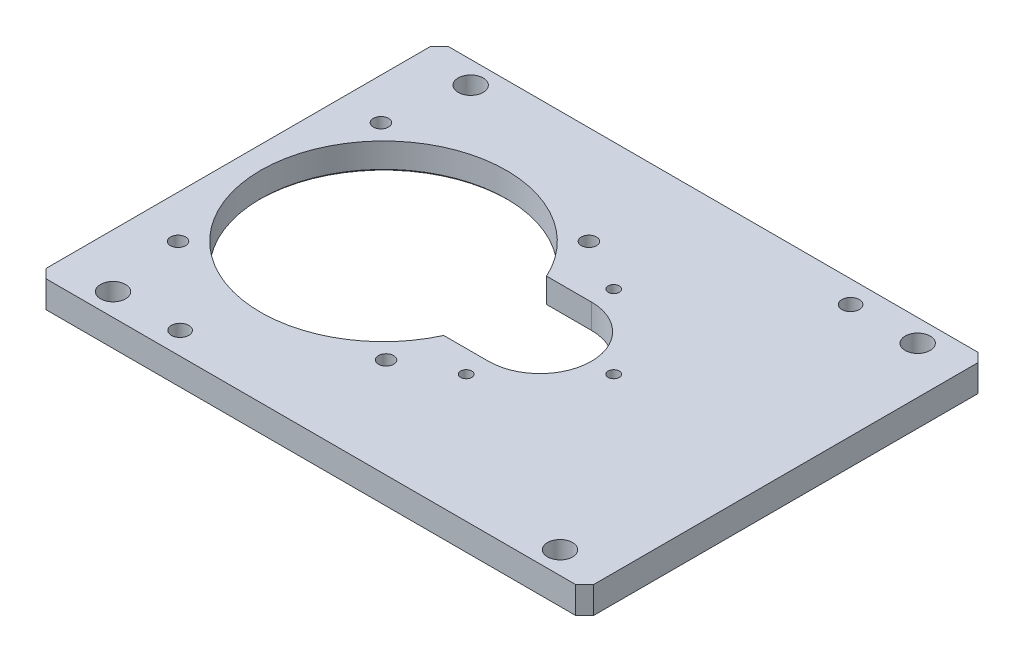
ISO-10303-21;
HEADER;
FILE_DESCRIPTION(('STEP AP214'),'2;1');
FILE_NAME('part.step','',(''),(''),'','','');
FILE_SCHEMA(('AUTOMOTIVE_DESIGN { 1 0 10303 214 1 1 1 1 }'));
ENDSEC;
DATA;
#1=APPLICATION_CONTEXT('core data for automotive mechanical design processes');
#2=APPLICATION_PROTOCOL_DEFINITION('international standard','automotive_design',2000,#1);
#3=PRODUCT_CONTEXT('',#1,'mechanical');
#4=PRODUCT('Part','Part','',(#3));
#5=PRODUCT_RELATED_PRODUCT_CATEGORY('part','',(#4));
#6=PRODUCT_DEFINITION_FORMATION('','',#4);
#7=PRODUCT_DEFINITION_CONTEXT('part definition',#1,'design');
#8=PRODUCT_DEFINITION('design','',#6,#7);
#9=PRODUCT_DEFINITION_SHAPE('','',#8);
#10=(LENGTH_UNIT() NAMED_UNIT(*) SI_UNIT(.MILLI.,.METRE.));
#11=(NAMED_UNIT(*) PLANE_ANGLE_UNIT() SI_UNIT($,.RADIAN.));
#12=(NAMED_UNIT(*) SI_UNIT($,.STERADIAN.) SOLID_ANGLE_UNIT());
#13=UNCERTAINTY_MEASURE_WITH_UNIT(LENGTH_MEASURE(1.E-05),#10,'distance_accuracy_value','');
#14=(GEOMETRIC_REPRESENTATION_CONTEXT(3) GLOBAL_UNCERTAINTY_ASSIGNED_CONTEXT((#13)) GLOBAL_UNIT_ASSIGNED_CONTEXT((#10,
#11,#12)) REPRESENTATION_CONTEXT('',''));
#15=CARTESIAN_POINT('',(0.,0.,0.));
#16=DIRECTION('',(0.,0.,1.));
#17=DIRECTION('',(1.,0.,0.));
#18=AXIS2_PLACEMENT_3D('',#15,#16,#17);
#19=CARTESIAN_POINT('',(0.,12.,0.));
#20=DIRECTION('',(0.,1.,0.));
#21=DIRECTION('',(0.,0.,1.));
#22=AXIS2_PLACEMENT_3D('',#19,#20,#21);
#23=PLANE('',#22);
#24=CARTESIAN_POINT('',(59.,12.,-80.));
#25=DIRECTION('',(0.,1.,0.));
#26=DIRECTION('',(0.,0.,1.));
#27=AXIS2_PLACEMENT_3D('',#24,#25,#26);
#28=CIRCLE('',#27,3.9);
#29=CARTESIAN_POINT('',(59.,12.,-76.1));
#30=VERTEX_POINT('',#29);
#31=EDGE_CURVE('E503',#30,#30,#28,.T.);
#32=ORIENTED_EDGE('',*,*,#31,.F.);
#33=EDGE_LOOP('',(#32));
#34=FACE_BOUND('',#33,.T.);
#35=CARTESIAN_POINT('',(-81.,12.,80.));
#36=DIRECTION('',(0.,1.,0.));
#37=DIRECTION('',(0.,0.,1.));
#38=AXIS2_PLACEMENT_3D('',#35,#36,#37);
#39=CIRCLE('',#38,3.9);
#40=CARTESIAN_POINT('',(-81.,12.,83.9));
#41=VERTEX_POINT('',#40);
#42=EDGE_CURVE('E508',#41,#41,#39,.T.);
#43=ORIENTED_EDGE('',*,*,#42,.F.);
#44=EDGE_LOOP('',(#43));
#45=FACE_BOUND('',#44,.T.);
#46=CARTESIAN_POINT('',(89.,12.,80.));
#47=DIRECTION('',(0.,1.,0.));
#48=DIRECTION('',(0.,0.,1.));
#49=AXIS2_PLACEMENT_3D('',#46,#47,#48);
#50=CIRCLE('',#49,5.6);
#51=CARTESIAN_POINT('',(89.,12.,85.6));
#52=VERTEX_POINT('',#51);
#53=EDGE_CURVE('E521',#52,#52,#50,.T.);
#54=ORIENTED_EDGE('',*,*,#53,.F.);
#55=EDGE_LOOP('',(#54));
#56=FACE_BOUND('',#55,.T.);
#57=CARTESIAN_POINT('',(89.,12.,-80.));
#58=DIRECTION('',(0.,1.,0.));
#59=DIRECTION('',(0.,0.,1.));
#60=AXIS2_PLACEMENT_3D('',#57,#58,#59);
#61=CIRCLE('',#60,5.6);
#62=CARTESIAN_POINT('',(89.,12.,-74.4));
#63=VERTEX_POINT('',#62);
#64=EDGE_CURVE('E531',#63,#63,#61,.T.);
#65=ORIENTED_EDGE('',*,*,#64,.F.);
#66=EDGE_LOOP('',(#65));
#67=FACE_BOUND('',#66,.T.);
#68=CARTESIAN_POINT('',(-111.,12.,-80.));
#69=DIRECTION('',(0.,1.,0.));
#70=DIRECTION('',(0.,0.,1.));
#71=AXIS2_PLACEMENT_3D('',#68,#69,#70);
#72=CIRCLE('',#71,5.6);
#73=CARTESIAN_POINT('',(-111.,12.,-74.4));
#74=VERTEX_POINT('',#73);
#75=EDGE_CURVE('E520',#74,#74,#72,.T.);
#76=ORIENTED_EDGE('',*,*,#75,.F.);
#77=EDGE_LOOP('',(#76));
#78=FACE_BOUND('',#77,.T.);
#79=CARTESIAN_POINT('',(-111.,12.,80.));
#80=DIRECTION('',(0.,1.,0.));
#81=DIRECTION('',(0.,0.,1.));
#82=AXIS2_PLACEMENT_3D('',#79,#80,#81);
#83=CIRCLE('',#82,5.6);
#84=CARTESIAN_POINT('',(-111.,12.,85.6));
#85=VERTEX_POINT('',#84);
#86=EDGE_CURVE('E530',#85,#85,#83,.T.);
#87=ORIENTED_EDGE('',*,*,#86,.F.);
#88=EDGE_LOOP('',(#87));
#89=FACE_BOUND('',#88,.T.);
#90=CARTESIAN_POINT('',(-23.4704473991865,12.,45.3872309660782));
#91=DIRECTION('',(0.,1.,0.));
#92=DIRECTION('',(0.,0.,1.));
#93=AXIS2_PLACEMENT_3D('',#90,#91,#92);
#94=CIRCLE('',#93,3.39999999999999);
#95=CARTESIAN_POINT('',(-23.4704473991865,12.,48.7872309660782));
#96=VERTEX_POINT('',#95);
#97=EDGE_CURVE('E552',#96,#96,#94,.T.);
#98=ORIENTED_EDGE('',*,*,#97,.F.);
#99=EDGE_LOOP('',(#98));
#100=FACE_BOUND('',#99,.T.);
#101=CARTESIAN_POINT('',(-24.0380592228745,12.,-45.9619407771257));
#102=DIRECTION('',(0.,1.,0.));
#103=DIRECTION('',(0.,0.,1.));
#104=AXIS2_PLACEMENT_3D('',#101,#102,#103);
#105=CIRCLE('',#104,3.39999999999999);
#106=CARTESIAN_POINT('',(-24.0380592228745,12.,-42.5619407771257));
#107=VERTEX_POINT('',#106);
#108=EDGE_CURVE('E560',#107,#107,#105,.T.);
#109=ORIENTED_EDGE('',*,*,#108,.F.);
#110=EDGE_LOOP('',(#109));
#111=FACE_BOUND('',#110,.T.);
#112=CARTESIAN_POINT('',(-116.529552600814,12.,-45.3872309660782));
#113=DIRECTION('',(0.,1.,0.));
#114=DIRECTION('',(0.,0.,1.));
#115=AXIS2_PLACEMENT_3D('',#112,#113,#114);
#116=CIRCLE('',#115,3.39999999999999);
#117=CARTESIAN_POINT('',(-116.529552600814,12.,-41.9872309660782));
#118=VERTEX_POINT('',#117);
#119=EDGE_CURVE('E568',#118,#118,#116,.T.);
#120=ORIENTED_EDGE('',*,*,#119,.F.);
#121=EDGE_LOOP('',(#120));
#122=FACE_BOUND('',#121,.T.);
#123=CARTESIAN_POINT('',(33.,12.,0.));
#124=DIRECTION('',(0.,1.,0.));
#125=DIRECTION('',(0.,0.,1.));
#126=AXIS2_PLACEMENT_3D('',#123,#124,#125);
#127=CIRCLE('',#126,2.5);
#128=CARTESIAN_POINT('',(33.,12.,2.5));
#129=VERTEX_POINT('',#128);
#130=EDGE_CURVE('E576',#129,#129,#127,.T.);
#131=ORIENTED_EDGE('',*,*,#130,.F.);
#132=EDGE_LOOP('',(#131));
#133=FACE_BOUND('',#132,.T.);
#134=CARTESIAN_POINT('',(0.,12.,33.));
#135=DIRECTION('',(0.,1.,0.));
#136=DIRECTION('',(0.,0.,1.));
#137=AXIS2_PLACEMENT_3D('',#134,#135,#136);
#138=CIRCLE('',#137,2.5);
#139=CARTESIAN_POINT('',(0.,12.,35.5));
#140=VERTEX_POINT('',#139);
#141=EDGE_CURVE('E584',#140,#140,#138,.T.);
#142=ORIENTED_EDGE('',*,*,#141,.F.);
#143=EDGE_LOOP('',(#142));
#144=FACE_BOUND('',#143,.T.);
#145=CARTESIAN_POINT('',(0.,12.,-33.));
#146=DIRECTION('',(0.,1.,0.));
#147=DIRECTION('',(0.,0.,1.));
#148=AXIS2_PLACEMENT_3D('',#145,#146,#147);
#149=CIRCLE('',#148,2.5);
#150=CARTESIAN_POINT('',(0.,12.,-30.5));
#151=VERTEX_POINT('',#150);
#152=EDGE_CURVE('E347',#151,#151,#149,.T.);
#153=ORIENTED_EDGE('',*,*,#152,.F.);
#154=EDGE_LOOP('',(#153));
#155=FACE_BOUND('',#154,.T.);
#156=CARTESIAN_POINT('',(-115.961940777125,12.,45.9619407771257));
#157=DIRECTION('',(0.,1.,0.));
#158=DIRECTION('',(0.,0.,1.));
#159=AXIS2_PLACEMENT_3D('',#156,#157,#158);
#160=CIRCLE('',#159,3.39999999999999);
#161=CARTESIAN_POINT('',(-115.961940777125,12.,49.3619407771257));
#162=VERTEX_POINT('',#161);
#163=EDGE_CURVE('E598',#162,#162,#160,.T.);
#164=ORIENTED_EDGE('',*,*,#163,.F.);
#165=EDGE_LOOP('',(#164));
#166=FACE_BOUND('',#165,.T.);
#167=DIRECTION('',(-1.,0.,0.));
#168=VECTOR('',#167,1.);
#169=CARTESIAN_POINT('',(-135.,12.,-90.));
#170=LINE('',#169,#168);
#171=CARTESIAN_POINT('',(106.,12.,-90.));
#172=VERTEX_POINT('',#171);
#173=CARTESIAN_POINT('',(-131.,12.,-90.));
#174=VERTEX_POINT('',#173);
#175=EDGE_CURVE('E213',#172,#174,#170,.T.);
#176=ORIENTED_EDGE('',*,*,#175,.T.);
#177=DIRECTION('',(0.70710678118655,0.,-0.707106781186545));
#178=VECTOR('',#177,1.);
#179=CARTESIAN_POINT('',(-110.5,12.,-110.5));
#180=LINE('',#179,#178);
#181=CARTESIAN_POINT('',(-135.,12.,-86.));
#182=VERTEX_POINT('',#181);
#183=EDGE_CURVE('E266',#174,#182,#180,.F.);
#184=ORIENTED_EDGE('',*,*,#183,.T.);
#185=DIRECTION('',(0.,0.,1.));
#186=VECTOR('',#185,1.);
#187=CARTESIAN_POINT('',(-135.,12.,-90.));
#188=LINE('',#187,#186);
#189=CARTESIAN_POINT('',(-135.,12.,85.9999999999999));
#190=VERTEX_POINT('',#189);
#191=EDGE_CURVE('E200',#182,#190,#188,.T.);
#192=ORIENTED_EDGE('',*,*,#191,.T.);
#193=DIRECTION('',(-0.707106781186548,0.,-0.707106781186548));
#194=VECTOR('',#193,1.);
#195=CARTESIAN_POINT('',(-110.5,12.,110.5));
#196=LINE('',#195,#194);
#197=CARTESIAN_POINT('',(-131.,12.,90.));
#198=VERTEX_POINT('',#197);
#199=EDGE_CURVE('E257',#190,#198,#196,.F.);
#200=ORIENTED_EDGE('',*,*,#199,.T.);
#201=DIRECTION('',(1.,0.,0.));
#202=VECTOR('',#201,1.);
#203=CARTESIAN_POINT('',(-135.,12.,90.));
#204=LINE('',#203,#202);
#205=CARTESIAN_POINT('',(106.,12.,90.));
#206=VERTEX_POINT('',#205);
#207=EDGE_CURVE('E204',#198,#206,#204,.T.);
#208=ORIENTED_EDGE('',*,*,#207,.T.);
#209=DIRECTION('',(-0.707106781186551,0.,0.707106781186544));
#210=VECTOR('',#209,1.);
#211=CARTESIAN_POINT('',(97.9999999999994,12.,98.0000000000005));
#212=LINE('',#211,#210);
#213=CARTESIAN_POINT('',(110.,12.,86.));
#214=VERTEX_POINT('',#213);
#215=EDGE_CURVE('E260',#206,#214,#212,.F.);
#216=ORIENTED_EDGE('',*,*,#215,.T.);
#217=DIRECTION('',(0.,0.,-1.));
#218=VECTOR('',#217,1.);
#219=CARTESIAN_POINT('',(110.,12.,-90.));
#220=LINE('',#219,#218);
#221=CARTESIAN_POINT('',(110.,12.,-85.9999999999999));
#222=VERTEX_POINT('',#221);
#223=EDGE_CURVE('E209',#214,#222,#220,.T.);
#224=ORIENTED_EDGE('',*,*,#223,.T.);
#225=DIRECTION('',(0.707106781186544,0.,0.707106781186551));
#226=VECTOR('',#225,1.);
#227=CARTESIAN_POINT('',(98.0000000000005,12.,-97.9999999999995));
#228=LINE('',#227,#226);
#229=EDGE_CURVE('E263',#222,#172,#228,.F.);
#230=ORIENTED_EDGE('',*,*,#229,.T.);
#231=EDGE_LOOP('',(#176,#184,#192,#200,#208,#216,#224,#230));
#232=FACE_BOUND('',#231,.T.);
#233=DIRECTION('',(-1.,0.,0.));
#234=VECTOR('',#233,1.);
#235=CARTESIAN_POINT('',(0.,12.,-23.));
#236=LINE('',#235,#234);
#237=CARTESIAN_POINT('',(0.,12.,-23.));
#238=VERTEX_POINT('',#237);
#239=CARTESIAN_POINT('',(-20.0400160128128,12.,-23.));
#240=VERTEX_POINT('',#239);
#241=EDGE_CURVE('E167',#238,#240,#236,.T.);
#242=ORIENTED_EDGE('',*,*,#241,.F.);
#243=CARTESIAN_POINT('',(0.,12.,0.));
#244=DIRECTION('',(0.,1.,0.));
#245=DIRECTION('',(0.,0.,1.));
#246=AXIS2_PLACEMENT_3D('',#243,#244,#245);
#247=CIRCLE('',#246,23.);
#248=CARTESIAN_POINT('',(0.,12.,23.));
#249=VERTEX_POINT('',#248);
#250=EDGE_CURVE('E158',#249,#238,#247,.T.);
#251=ORIENTED_EDGE('',*,*,#250,.F.);
#252=DIRECTION('',(1.,0.,0.));
#253=VECTOR('',#252,1.);
#254=CARTESIAN_POINT('',(0.,12.,23.));
#255=LINE('',#254,#253);
#256=CARTESIAN_POINT('',(-20.0400160128128,12.,23.));
#257=VERTEX_POINT('',#256);
#258=EDGE_CURVE('E187',#257,#249,#255,.T.);
#259=ORIENTED_EDGE('',*,*,#258,.F.);
#260=CARTESIAN_POINT('',(-70.,12.,0.));
#261=DIRECTION('',(0.,1.,0.));
#262=DIRECTION('',(0.,0.,1.));
#263=AXIS2_PLACEMENT_3D('',#260,#261,#262);
#264=CIRCLE('',#263,55.);
#265=EDGE_CURVE('E183',#240,#257,#264,.T.);
#266=ORIENTED_EDGE('',*,*,#265,.F.);
#267=EDGE_LOOP('',(#242,#251,#259,#266));
#268=FACE_BOUND('',#267,.T.);
#269=ADVANCED_FACE('F55',(#34,#45,#56,#67,#78,#89,#100,#111,#122,#133,#144,#155,#166,#232,#268),
#23,.T.);
#270=CARTESIAN_POINT('',(0.,0.,0.));
#271=DIRECTION('',(0.,1.,0.));
#272=DIRECTION('',(0.,0.,1.));
#273=AXIS2_PLACEMENT_3D('',#270,#271,#272);
#274=PLANE('',#273);
#275=CARTESIAN_POINT('',(59.,0.,-80.));
#276=DIRECTION('',(0.,1.,0.));
#277=DIRECTION('',(0.,0.,1.));
#278=AXIS2_PLACEMENT_3D('',#275,#276,#277);
#279=CIRCLE('',#278,3.9);
#280=CARTESIAN_POINT('',(59.,0.,-76.1));
#281=VERTEX_POINT('',#280);
#282=EDGE_CURVE('E506',#281,#281,#279,.F.);
#283=ORIENTED_EDGE('',*,*,#282,.F.);
#284=EDGE_LOOP('',(#283));
#285=FACE_BOUND('',#284,.T.);
#286=CARTESIAN_POINT('',(-81.,0.,80.));
#287=DIRECTION('',(0.,1.,0.));
#288=DIRECTION('',(0.,0.,1.));
#289=AXIS2_PLACEMENT_3D('',#286,#287,#288);
#290=CIRCLE('',#289,3.9);
#291=CARTESIAN_POINT('',(-81.,0.,83.9));
#292=VERTEX_POINT('',#291);
#293=EDGE_CURVE('E513',#292,#292,#290,.F.);
#294=ORIENTED_EDGE('',*,*,#293,.F.);
#295=EDGE_LOOP('',(#294));
#296=FACE_BOUND('',#295,.T.);
#297=CARTESIAN_POINT('',(89.,0.,80.));
#298=DIRECTION('',(0.,1.,0.));
#299=DIRECTION('',(0.,0.,1.));
#300=AXIS2_PLACEMENT_3D('',#297,#298,#299);
#301=CIRCLE('',#300,5.6);
#302=CARTESIAN_POINT('',(89.,0.,85.6));
#303=VERTEX_POINT('',#302);
#304=EDGE_CURVE('E525',#303,#303,#301,.F.);
#305=ORIENTED_EDGE('',*,*,#304,.F.);
#306=EDGE_LOOP('',(#305));
#307=FACE_BOUND('',#306,.T.);
#308=CARTESIAN_POINT('',(89.,0.,-80.));
#309=DIRECTION('',(0.,1.,0.));
#310=DIRECTION('',(0.,0.,1.));
#311=AXIS2_PLACEMENT_3D('',#308,#309,#310);
#312=CIRCLE('',#311,5.6);
#313=CARTESIAN_POINT('',(89.,0.,-74.4));
#314=VERTEX_POINT('',#313);
#315=EDGE_CURVE('E526',#314,#314,#312,.F.);
#316=ORIENTED_EDGE('',*,*,#315,.F.);
#317=EDGE_LOOP('',(#316));
#318=FACE_BOUND('',#317,.T.);
#319=CARTESIAN_POINT('',(-111.,0.,-80.));
#320=DIRECTION('',(0.,1.,0.));
#321=DIRECTION('',(0.,0.,1.));
#322=AXIS2_PLACEMENT_3D('',#319,#320,#321);
#323=CIRCLE('',#322,5.6);
#324=CARTESIAN_POINT('',(-111.,0.,-74.4));
#325=VERTEX_POINT('',#324);
#326=EDGE_CURVE('E535',#325,#325,#323,.F.);
#327=ORIENTED_EDGE('',*,*,#326,.F.);
#328=EDGE_LOOP('',(#327));
#329=FACE_BOUND('',#328,.T.);
#330=CARTESIAN_POINT('',(-111.,0.,80.));
#331=DIRECTION('',(0.,1.,0.));
#332=DIRECTION('',(0.,0.,1.));
#333=AXIS2_PLACEMENT_3D('',#330,#331,#332);
#334=CIRCLE('',#333,5.6);
#335=CARTESIAN_POINT('',(-111.,0.,85.6));
#336=VERTEX_POINT('',#335);
#337=EDGE_CURVE('E548',#336,#336,#334,.F.);
#338=ORIENTED_EDGE('',*,*,#337,.F.);
#339=EDGE_LOOP('',(#338));
#340=FACE_BOUND('',#339,.T.);
#341=CARTESIAN_POINT('',(-23.4704473991865,0.,45.3872309660782));
#342=DIRECTION('',(0.,1.,0.));
#343=DIRECTION('',(0.,0.,1.));
#344=AXIS2_PLACEMENT_3D('',#341,#342,#343);
#345=CIRCLE('',#344,3.39999999999999);
#346=CARTESIAN_POINT('',(-23.4704473991865,0.,48.7872309660782));
#347=VERTEX_POINT('',#346);
#348=EDGE_CURVE('E556',#347,#347,#345,.T.);
#349=ORIENTED_EDGE('',*,*,#348,.T.);
#350=EDGE_LOOP('',(#349));
#351=FACE_BOUND('',#350,.T.);
#352=CARTESIAN_POINT('',(-24.0380592228745,0.,-45.9619407771257));
#353=DIRECTION('',(0.,1.,0.));
#354=DIRECTION('',(0.,0.,1.));
#355=AXIS2_PLACEMENT_3D('',#352,#353,#354);
#356=CIRCLE('',#355,3.39999999999999);
#357=CARTESIAN_POINT('',(-24.0380592228745,0.,-42.5619407771257));
#358=VERTEX_POINT('',#357);
#359=EDGE_CURVE('E564',#358,#358,#356,.T.);
#360=ORIENTED_EDGE('',*,*,#359,.T.);
#361=EDGE_LOOP('',(#360));
#362=FACE_BOUND('',#361,.T.);
#363=CARTESIAN_POINT('',(-116.529552600814,0.,-45.3872309660782));
#364=DIRECTION('',(0.,1.,0.));
#365=DIRECTION('',(0.,0.,1.));
#366=AXIS2_PLACEMENT_3D('',#363,#364,#365);
#367=CIRCLE('',#366,3.39999999999999);
#368=CARTESIAN_POINT('',(-116.529552600814,0.,-41.9872309660782));
#369=VERTEX_POINT('',#368);
#370=EDGE_CURVE('E572',#369,#369,#367,.T.);
#371=ORIENTED_EDGE('',*,*,#370,.T.);
#372=EDGE_LOOP('',(#371));
#373=FACE_BOUND('',#372,.T.);
#374=CARTESIAN_POINT('',(33.,0.,0.));
#375=DIRECTION('',(0.,1.,0.));
#376=DIRECTION('',(0.,0.,1.));
#377=AXIS2_PLACEMENT_3D('',#374,#375,#376);
#378=CIRCLE('',#377,2.5);
#379=CARTESIAN_POINT('',(33.,0.,2.5));
#380=VERTEX_POINT('',#379);
#381=EDGE_CURVE('E580',#380,#380,#378,.T.);
#382=ORIENTED_EDGE('',*,*,#381,.T.);
#383=EDGE_LOOP('',(#382));
#384=FACE_BOUND('',#383,.T.);
#385=CARTESIAN_POINT('',(0.,0.,33.));
#386=DIRECTION('',(0.,1.,0.));
#387=DIRECTION('',(0.,0.,1.));
#388=AXIS2_PLACEMENT_3D('',#385,#386,#387);
#389=CIRCLE('',#388,2.5);
#390=CARTESIAN_POINT('',(0.,0.,35.5));
#391=VERTEX_POINT('',#390);
#392=EDGE_CURVE('E312',#391,#391,#389,.T.);
#393=ORIENTED_EDGE('',*,*,#392,.T.);
#394=EDGE_LOOP('',(#393));
#395=FACE_BOUND('',#394,.T.);
#396=CARTESIAN_POINT('',(0.,0.,0.));
#397=DIRECTION('',(0.,1.,0.));
#398=DIRECTION('',(0.,0.,1.));
#399=AXIS2_PLACEMENT_3D('',#396,#397,#398);
#400=CIRCLE('',#399,24.);
#401=CARTESIAN_POINT('',(0.,0.,24.));
#402=VERTEX_POINT('',#401);
#403=CARTESIAN_POINT('',(0.,0.,-24.));
#404=VERTEX_POINT('',#403);
#405=EDGE_CURVE('E289',#402,#404,#400,.T.);
#406=ORIENTED_EDGE('',*,*,#405,.T.);
#407=DIRECTION('',(-1.,0.,0.));
#408=VECTOR('',#407,1.);
#409=CARTESIAN_POINT('',(-20.0400160128128,0.,-24.));
#410=LINE('',#409,#408);
#411=CARTESIAN_POINT('',(-19.403557437306,0.,-24.));
#412=VERTEX_POINT('',#411);
#413=EDGE_CURVE('E292',#404,#412,#410,.T.);
#414=ORIENTED_EDGE('',*,*,#413,.T.);
#415=CARTESIAN_POINT('',(-70.,0.,0.));
#416=DIRECTION('',(0.,1.,0.));
#417=DIRECTION('',(0.,0.,1.));
#418=AXIS2_PLACEMENT_3D('',#415,#416,#417);
#419=CIRCLE('',#418,56.);
#420=CARTESIAN_POINT('',(-19.403557437306,0.,24.));
#421=VERTEX_POINT('',#420);
#422=EDGE_CURVE('E283',#412,#421,#419,.T.);
#423=ORIENTED_EDGE('',*,*,#422,.T.);
#424=DIRECTION('',(1.,0.,0.));
#425=VECTOR('',#424,1.);
#426=CARTESIAN_POINT('',(0.,0.,24.));
#427=LINE('',#426,#425);
#428=EDGE_CURVE('E286',#421,#402,#427,.T.);
#429=ORIENTED_EDGE('',*,*,#428,.T.);
#430=EDGE_LOOP('',(#406,#414,#423,#429));
#431=FACE_BOUND('',#430,.T.);
#432=CARTESIAN_POINT('',(0.,0.,-33.));
#433=DIRECTION('',(0.,1.,0.));
#434=DIRECTION('',(0.,0.,1.));
#435=AXIS2_PLACEMENT_3D('',#432,#433,#434);
#436=CIRCLE('',#435,2.5);
#437=CARTESIAN_POINT('',(0.,0.,-30.5));
#438=VERTEX_POINT('',#437);
#439=EDGE_CURVE('E594',#438,#438,#436,.T.);
#440=ORIENTED_EDGE('',*,*,#439,.T.);
#441=EDGE_LOOP('',(#440));
#442=FACE_BOUND('',#441,.T.);
#443=CARTESIAN_POINT('',(-115.961940777125,0.,45.9619407771257));
#444=DIRECTION('',(0.,1.,0.));
#445=DIRECTION('',(0.,0.,1.));
#446=AXIS2_PLACEMENT_3D('',#443,#444,#445);
#447=CIRCLE('',#446,3.39999999999999);
#448=CARTESIAN_POINT('',(-115.961940777125,0.,49.3619407771257));
#449=VERTEX_POINT('',#448);
#450=EDGE_CURVE('E168',#449,#449,#447,.T.);
#451=ORIENTED_EDGE('',*,*,#450,.T.);
#452=EDGE_LOOP('',(#451));
#453=FACE_BOUND('',#452,.T.);
#454=DIRECTION('',(0.,0.,1.));
#455=VECTOR('',#454,1.);
#456=CARTESIAN_POINT('',(-135.,0.,-90.));
#457=LINE('',#456,#455);
#458=CARTESIAN_POINT('',(-135.,0.,-86.));
#459=VERTEX_POINT('',#458);
#460=CARTESIAN_POINT('',(-135.,0.,85.9999999999999));
#461=VERTEX_POINT('',#460);
#462=EDGE_CURVE('E178',#459,#461,#457,.T.);
#463=ORIENTED_EDGE('',*,*,#462,.F.);
#464=DIRECTION('',(-0.70710678118655,0.,0.707106781186545));
#465=VECTOR('',#464,1.);
#466=CARTESIAN_POINT('',(-135.,0.,-86.));
#467=LINE('',#466,#465);
#468=CARTESIAN_POINT('',(-131.,0.,-90.));
#469=VERTEX_POINT('',#468);
#470=EDGE_CURVE('E247',#459,#469,#467,.F.);
#471=ORIENTED_EDGE('',*,*,#470,.T.);
#472=DIRECTION('',(-1.,0.,0.));
#473=VECTOR('',#472,1.);
#474=CARTESIAN_POINT('',(-135.,0.,-90.));
#475=LINE('',#474,#473);
#476=CARTESIAN_POINT('',(106.,0.,-90.));
#477=VERTEX_POINT('',#476);
#478=EDGE_CURVE('E205',#477,#469,#475,.T.);
#479=ORIENTED_EDGE('',*,*,#478,.F.);
#480=DIRECTION('',(-0.707106781186544,0.,-0.707106781186551));
#481=VECTOR('',#480,1.);
#482=CARTESIAN_POINT('',(106.,0.,-90.));
#483=LINE('',#482,#481);
#484=CARTESIAN_POINT('',(110.,0.,-85.9999999999999));
#485=VERTEX_POINT('',#484);
#486=EDGE_CURVE('E244',#477,#485,#483,.F.);
#487=ORIENTED_EDGE('',*,*,#486,.T.);
#488=DIRECTION('',(0.,0.,-1.));
#489=VECTOR('',#488,1.);
#490=CARTESIAN_POINT('',(110.,0.,-90.));
#491=LINE('',#490,#489);
#492=CARTESIAN_POINT('',(110.,0.,86.));
#493=VERTEX_POINT('',#492);
#494=EDGE_CURVE('E225',#493,#485,#491,.T.);
#495=ORIENTED_EDGE('',*,*,#494,.F.);
#496=DIRECTION('',(0.707106781186551,0.,-0.707106781186544));
#497=VECTOR('',#496,1.);
#498=CARTESIAN_POINT('',(110.,0.,86.));
#499=LINE('',#498,#497);
#500=CARTESIAN_POINT('',(106.,0.,90.));
#501=VERTEX_POINT('',#500);
#502=EDGE_CURVE('E241',#493,#501,#499,.F.);
#503=ORIENTED_EDGE('',*,*,#502,.T.);
#504=DIRECTION('',(1.,0.,0.));
#505=VECTOR('',#504,1.);
#506=CARTESIAN_POINT('',(-135.,0.,90.));
#507=LINE('',#506,#505);
#508=CARTESIAN_POINT('',(-131.,0.,90.));
#509=VERTEX_POINT('',#508);
#510=EDGE_CURVE('E221',#509,#501,#507,.T.);
#511=ORIENTED_EDGE('',*,*,#510,.F.);
#512=DIRECTION('',(0.707106781186548,0.,0.707106781186548));
#513=VECTOR('',#512,1.);
#514=CARTESIAN_POINT('',(-131.,0.,90.));
#515=LINE('',#514,#513);
#516=EDGE_CURVE('E238',#509,#461,#515,.F.);
#517=ORIENTED_EDGE('',*,*,#516,.T.);
#518=EDGE_LOOP('',(#463,#471,#479,#487,#495,#503,#511,#517));
#519=FACE_BOUND('',#518,.T.);
#520=ADVANCED_FACE('F371',(#285,#296,#307,#318,#329,#340,#351,#362,#373,#384,#395,#431,#442,
#453,#519),#274,.F.);
#521=CARTESIAN_POINT('',(-135.,12.,-90.));
#522=DIRECTION('',(1.,0.,0.));
#523=DIRECTION('',(0.,0.,-1.));
#524=AXIS2_PLACEMENT_3D('',#521,#522,#523);
#525=PLANE('',#524);
#526=ORIENTED_EDGE('',*,*,#191,.F.);
#527=DIRECTION('',(0.,-1.,0.));
#528=VECTOR('',#527,1.);
#529=CARTESIAN_POINT('',(-135.,12.,-86.));
#530=LINE('',#529,#528);
#531=EDGE_CURVE('E234',#182,#459,#530,.T.);
#532=ORIENTED_EDGE('',*,*,#531,.T.);
#533=ORIENTED_EDGE('',*,*,#462,.T.);
#534=DIRECTION('',(0.,1.,0.));
#535=VECTOR('',#534,1.);
#536=CARTESIAN_POINT('',(-135.,12.,86.));
#537=LINE('',#536,#535);
#538=EDGE_CURVE('E217',#461,#190,#537,.T.);
#539=ORIENTED_EDGE('',*,*,#538,.T.);
#540=EDGE_LOOP('',(#526,#532,#533,#539));
#541=FACE_BOUND('',#540,.T.);
#542=ADVANCED_FACE('F378',(#541),#525,.F.);
#543=CARTESIAN_POINT('',(-135.,12.,90.));
#544=DIRECTION('',(0.,0.,-1.));
#545=DIRECTION('',(-1.,0.,0.));
#546=AXIS2_PLACEMENT_3D('',#543,#544,#545);
#547=PLANE('',#546);
#548=ORIENTED_EDGE('',*,*,#510,.T.);
#549=DIRECTION('',(0.,1.,0.));
#550=VECTOR('',#549,1.);
#551=CARTESIAN_POINT('',(106.,12.,90.));
#552=LINE('',#551,#550);
#553=EDGE_CURVE('E280',#501,#206,#552,.T.);
#554=ORIENTED_EDGE('',*,*,#553,.T.);
#555=ORIENTED_EDGE('',*,*,#207,.F.);
#556=DIRECTION('',(0.,-1.,0.));
#557=VECTOR('',#556,1.);
#558=CARTESIAN_POINT('',(-131.,12.,90.));
#559=LINE('',#558,#557);
#560=EDGE_CURVE('E276',#198,#509,#559,.T.);
#561=ORIENTED_EDGE('',*,*,#560,.T.);
#562=EDGE_LOOP('',(#548,#554,#555,#561));
#563=FACE_BOUND('',#562,.T.);
#564=ADVANCED_FACE('F393',(#563),#547,.F.);
#565=CARTESIAN_POINT('',(110.,12.,-90.));
#566=DIRECTION('',(-1.,0.,0.));
#567=DIRECTION('',(0.,0.,1.));
#568=AXIS2_PLACEMENT_3D('',#565,#566,#567);
#569=PLANE('',#568);
#570=ORIENTED_EDGE('',*,*,#494,.T.);
#571=DIRECTION('',(0.,1.,0.));
#572=VECTOR('',#571,1.);
#573=CARTESIAN_POINT('',(110.,12.,-85.9999999999999));
#574=LINE('',#573,#572);
#575=EDGE_CURVE('E273',#485,#222,#574,.T.);
#576=ORIENTED_EDGE('',*,*,#575,.T.);
#577=ORIENTED_EDGE('',*,*,#223,.F.);
#578=DIRECTION('',(0.,-1.,0.));
#579=VECTOR('',#578,1.);
#580=CARTESIAN_POINT('',(110.,12.,86.));
#581=LINE('',#580,#579);
#582=EDGE_CURVE('E269',#214,#493,#581,.T.);
#583=ORIENTED_EDGE('',*,*,#582,.T.);
#584=EDGE_LOOP('',(#570,#576,#577,#583));
#585=FACE_BOUND('',#584,.T.);
#586=ADVANCED_FACE('F389',(#585),#569,.F.);
#587=CARTESIAN_POINT('',(-135.,12.,-90.));
#588=DIRECTION('',(0.,0.,1.));
#589=DIRECTION('',(1.,0.,0.));
#590=AXIS2_PLACEMENT_3D('',#587,#588,#589);
#591=PLANE('',#590);
#592=ORIENTED_EDGE('',*,*,#478,.T.);
#593=DIRECTION('',(0.,1.,0.));
#594=VECTOR('',#593,1.);
#595=CARTESIAN_POINT('',(-131.,12.,-90.));
#596=LINE('',#595,#594);
#597=EDGE_CURVE('E254',#469,#174,#596,.T.);
#598=ORIENTED_EDGE('',*,*,#597,.T.);
#599=ORIENTED_EDGE('',*,*,#175,.F.);
#600=DIRECTION('',(0.,-1.,0.));
#601=VECTOR('',#600,1.);
#602=CARTESIAN_POINT('',(106.,12.,-90.));
#603=LINE('',#602,#601);
#604=EDGE_CURVE('E250',#172,#477,#603,.T.);
#605=ORIENTED_EDGE('',*,*,#604,.T.);
#606=EDGE_LOOP('',(#592,#598,#599,#605));
#607=FACE_BOUND('',#606,.T.);
#608=ADVANCED_FACE('F386',(#607),#591,.F.);
#609=CARTESIAN_POINT('',(0.,12.,0.));
#610=DIRECTION('',(0.,-1.,0.));
#611=DIRECTION('',(0.,0.,-1.));
#612=AXIS2_PLACEMENT_3D('',#609,#610,#611);
#613=CYLINDRICAL_SURFACE('',#612,23.);
#614=DIRECTION('',(0.,-1.,0.));
#615=VECTOR('',#614,1.);
#616=CARTESIAN_POINT('',(0.,12.,-23.));
#617=LINE('',#616,#615);
#618=CARTESIAN_POINT('',(0.,0.999999999999959,-23.));
#619=VERTEX_POINT('',#618);
#620=EDGE_CURVE('E161',#238,#619,#617,.T.);
#621=ORIENTED_EDGE('',*,*,#620,.T.);
#622=CARTESIAN_POINT('',(0.,0.999999999999959,0.));
#623=DIRECTION('',(0.,1.,0.));
#624=DIRECTION('',(0.,0.,1.));
#625=AXIS2_PLACEMENT_3D('',#622,#623,#624);
#626=CIRCLE('',#625,23.);
#627=CARTESIAN_POINT('',(0.,0.999999999999959,23.));
#628=VERTEX_POINT('',#627);
#629=EDGE_CURVE('E81',#619,#628,#626,.F.);
#630=ORIENTED_EDGE('',*,*,#629,.T.);
#631=DIRECTION('',(0.,-1.,0.));
#632=VECTOR('',#631,1.);
#633=CARTESIAN_POINT('',(0.,12.,23.));
#634=LINE('',#633,#632);
#635=EDGE_CURVE('E162',#249,#628,#634,.T.);
#636=ORIENTED_EDGE('',*,*,#635,.F.);
#637=ORIENTED_EDGE('',*,*,#250,.T.);
#638=EDGE_LOOP('',(#621,#630,#636,#637));
#639=FACE_BOUND('',#638,.T.);
#640=ADVANCED_FACE('F160',(#639),#613,.F.);
#641=CARTESIAN_POINT('',(0.,12.,-23.));
#642=DIRECTION('',(0.,0.,1.));
#643=DIRECTION('',(1.,0.,0.));
#644=AXIS2_PLACEMENT_3D('',#641,#642,#643);
#645=PLANE('',#644);
#646=DIRECTION('',(0.,-1.,0.));
#647=VECTOR('',#646,1.);
#648=CARTESIAN_POINT('',(-20.0400160128128,12.,-23.));
#649=LINE('',#648,#647);
#650=CARTESIAN_POINT('',(-20.0400160128128,0.999999999999959,-23.));
#651=VERTEX_POINT('',#650);
#652=EDGE_CURVE('E179',#240,#651,#649,.T.);
#653=ORIENTED_EDGE('',*,*,#652,.T.);
#654=DIRECTION('',(1.,0.,0.));
#655=VECTOR('',#654,1.);
#656=CARTESIAN_POINT('',(0.,0.999999999999959,-23.));
#657=LINE('',#656,#655);
#658=EDGE_CURVE('E176',#651,#619,#657,.T.);
#659=ORIENTED_EDGE('',*,*,#658,.T.);
#660=ORIENTED_EDGE('',*,*,#620,.F.);
#661=ORIENTED_EDGE('',*,*,#241,.T.);
#662=EDGE_LOOP('',(#653,#659,#660,#661));
#663=FACE_BOUND('',#662,.T.);
#664=ADVANCED_FACE('F173',(#663),#645,.T.);
#665=CARTESIAN_POINT('',(-70.,12.,0.));
#666=DIRECTION('',(0.,-1.,0.));
#667=DIRECTION('',(0.,0.,-1.));
#668=AXIS2_PLACEMENT_3D('',#665,#666,#667);
#669=CYLINDRICAL_SURFACE('',#668,55.);
#670=DIRECTION('',(0.,-1.,0.));
#671=VECTOR('',#670,1.);
#672=CARTESIAN_POINT('',(-20.0400160128128,12.,23.));
#673=LINE('',#672,#671);
#674=CARTESIAN_POINT('',(-20.0400160128128,0.999999999999959,23.));
#675=VERTEX_POINT('',#674);
#676=EDGE_CURVE('E195',#257,#675,#673,.T.);
#677=ORIENTED_EDGE('',*,*,#676,.T.);
#678=CARTESIAN_POINT('',(-70.,0.999999999999959,0.));
#679=DIRECTION('',(0.,1.,0.));
#680=DIRECTION('',(0.,0.,1.));
#681=AXIS2_PLACEMENT_3D('',#678,#679,#680);
#682=CIRCLE('',#681,55.);
#683=EDGE_CURVE('E11',#675,#651,#682,.F.);
#684=ORIENTED_EDGE('',*,*,#683,.T.);
#685=ORIENTED_EDGE('',*,*,#652,.F.);
#686=ORIENTED_EDGE('',*,*,#265,.T.);
#687=EDGE_LOOP('',(#677,#684,#685,#686));
#688=FACE_BOUND('',#687,.T.);
#689=ADVANCED_FACE('F356',(#688),#669,.F.);
#690=CARTESIAN_POINT('',(0.,12.,23.));
#691=DIRECTION('',(0.,0.,-1.));
#692=DIRECTION('',(-1.,0.,0.));
#693=AXIS2_PLACEMENT_3D('',#690,#691,#692);
#694=PLANE('',#693);
#695=ORIENTED_EDGE('',*,*,#635,.T.);
#696=DIRECTION('',(-1.,0.,0.));
#697=VECTOR('',#696,1.);
#698=CARTESIAN_POINT('',(-20.0400160128128,0.999999999999959,23.));
#699=LINE('',#698,#697);
#700=EDGE_CURVE('E66',#628,#675,#699,.T.);
#701=ORIENTED_EDGE('',*,*,#700,.T.);
#702=ORIENTED_EDGE('',*,*,#676,.F.);
#703=ORIENTED_EDGE('',*,*,#258,.T.);
#704=EDGE_LOOP('',(#695,#701,#702,#703));
#705=FACE_BOUND('',#704,.T.);
#706=ADVANCED_FACE('F357',(#705),#694,.T.);
#707=CARTESIAN_POINT('',(-135.,12.,-86.));
#708=DIRECTION('',(0.707106781186545,0.,0.70710678118655));
#709=DIRECTION('',(0.,-1.,0.));
#710=AXIS2_PLACEMENT_3D('',#707,#708,#709);
#711=PLANE('',#710);
#712=ORIENTED_EDGE('',*,*,#183,.F.);
#713=ORIENTED_EDGE('',*,*,#597,.F.);
#714=ORIENTED_EDGE('',*,*,#470,.F.);
#715=ORIENTED_EDGE('',*,*,#531,.F.);
#716=EDGE_LOOP('',(#712,#713,#714,#715));
#717=FACE_BOUND('',#716,.T.);
#718=ADVANCED_FACE('F359',(#717),#711,.F.);
#719=CARTESIAN_POINT('',(106.,12.,-90.));
#720=DIRECTION('',(-0.707106781186551,0.,0.707106781186544));
#721=DIRECTION('',(0.,-1.,0.));
#722=AXIS2_PLACEMENT_3D('',#719,#720,#721);
#723=PLANE('',#722);
#724=ORIENTED_EDGE('',*,*,#229,.F.);
#725=ORIENTED_EDGE('',*,*,#575,.F.);
#726=ORIENTED_EDGE('',*,*,#486,.F.);
#727=ORIENTED_EDGE('',*,*,#604,.F.);
#728=EDGE_LOOP('',(#724,#725,#726,#727));
#729=FACE_BOUND('',#728,.T.);
#730=ADVANCED_FACE('F365',(#729),#723,.F.);
#731=CARTESIAN_POINT('',(110.,12.,86.));
#732=DIRECTION('',(-0.707106781186544,0.,-0.707106781186551));
#733=DIRECTION('',(0.,-1.,0.));
#734=AXIS2_PLACEMENT_3D('',#731,#732,#733);
#735=PLANE('',#734);
#736=ORIENTED_EDGE('',*,*,#215,.F.);
#737=ORIENTED_EDGE('',*,*,#553,.F.);
#738=ORIENTED_EDGE('',*,*,#502,.F.);
#739=ORIENTED_EDGE('',*,*,#582,.F.);
#740=EDGE_LOOP('',(#736,#737,#738,#739));
#741=FACE_BOUND('',#740,.T.);
#742=ADVANCED_FACE('F410',(#741),#735,.F.);
#743=CARTESIAN_POINT('',(-131.,12.,90.));
#744=DIRECTION('',(0.707106781186547,0.,-0.707106781186547));
#745=DIRECTION('',(0.,-1.,0.));
#746=AXIS2_PLACEMENT_3D('',#743,#744,#745);
#747=PLANE('',#746);
#748=ORIENTED_EDGE('',*,*,#199,.F.);
#749=ORIENTED_EDGE('',*,*,#538,.F.);
#750=ORIENTED_EDGE('',*,*,#516,.F.);
#751=ORIENTED_EDGE('',*,*,#560,.F.);
#752=EDGE_LOOP('',(#748,#749,#750,#751));
#753=FACE_BOUND('',#752,.T.);
#754=ADVANCED_FACE('F416',(#753),#747,.F.);
#755=CARTESIAN_POINT('',(-115.961940777125,12.,45.9619407771257));
#756=DIRECTION('',(0.,1.,0.));
#757=DIRECTION('',(0.,0.,1.));
#758=AXIS2_PLACEMENT_3D('',#755,#756,#757);
#759=CYLINDRICAL_SURFACE('',#758,3.39999999999999);
#760=ORIENTED_EDGE('',*,*,#450,.F.);
#761=EDGE_LOOP('',(#760));
#762=FACE_BOUND('',#761,.T.);
#763=ORIENTED_EDGE('',*,*,#163,.T.);
#764=EDGE_LOOP('',(#763));
#765=FACE_BOUND('',#764,.T.);
#766=ADVANCED_FACE('F421',(#762,#765),#759,.F.);
#767=CARTESIAN_POINT('',(0.,12.,-33.));
#768=DIRECTION('',(0.,1.,0.));
#769=DIRECTION('',(0.,0.,1.));
#770=AXIS2_PLACEMENT_3D('',#767,#768,#769);
#771=CYLINDRICAL_SURFACE('',#770,2.5);
#772=ORIENTED_EDGE('',*,*,#439,.F.);
#773=EDGE_LOOP('',(#772));
#774=FACE_BOUND('',#773,.T.);
#775=ORIENTED_EDGE('',*,*,#152,.T.);
#776=EDGE_LOOP('',(#775));
#777=FACE_BOUND('',#776,.T.);
#778=ADVANCED_FACE('F331',(#774,#777),#771,.F.);
#779=CARTESIAN_POINT('',(0.,0.,24.));
#780=DIRECTION('',(0.,-0.707106781186552,-0.707106781186543));
#781=DIRECTION('',(-1.,0.,0.));
#782=AXIS2_PLACEMENT_3D('',#779,#780,#781);
#783=PLANE('',#782);
#784=CARTESIAN_POINT('',(-20.0400160128128,0.999999999999959,23.));
#785=CARTESIAN_POINT('',(-19.9333812704859,0.833511002372953,23.166488997627));
#786=CARTESIAN_POINT('',(-19.8270256840301,0.666933169171896,23.3330668308281));
#787=CARTESIAN_POINT('',(-19.6148728255419,0.333599835834086,23.6664001641659));
#788=CARTESIAN_POINT('',(-19.5090755534954,0.166844335701824,23.8331556642982));
#789=CARTESIAN_POINT('',(-19.403557437306,0.,24.));
#790=B_SPLINE_CURVE_WITH_KNOTS('',3,(#784,#785,#786,#787,#788,#789),.UNSPECIFIED.,.F.,.F.,(4,2,
4),(0.,0.775416493366264,1.5508329671343),.UNSPECIFIED.);
#791=EDGE_CURVE('E333',#675,#421,#790,.T.);
#792=ORIENTED_EDGE('',*,*,#791,.F.);
#793=ORIENTED_EDGE('',*,*,#700,.F.);
#794=DIRECTION('',(0.,0.707106781186543,-0.707106781186552));
#795=VECTOR('',#794,1.);
#796=CARTESIAN_POINT('',(0.,0.,24.));
#797=LINE('',#796,#795);
#798=EDGE_CURVE('E60',#402,#628,#797,.T.);
#799=ORIENTED_EDGE('',*,*,#798,.F.);
#800=ORIENTED_EDGE('',*,*,#428,.F.);
#801=EDGE_LOOP('',(#792,#793,#799,#800));
#802=FACE_BOUND('',#801,.T.);
#803=ADVANCED_FACE('F326',(#802),#783,.T.);
#804=CARTESIAN_POINT('',(0.,0.,0.));
#805=DIRECTION('',(0.,-1.,0.));
#806=DIRECTION('',(0.,0.,-1.));
#807=AXIS2_PLACEMENT_3D('',#804,#805,#806);
#808=CONICAL_SURFACE('',#807,24.,0.785398163397455);
#809=ORIENTED_EDGE('',*,*,#798,.T.);
#810=ORIENTED_EDGE('',*,*,#629,.F.);
#811=DIRECTION('',(0.,0.707106781186543,0.707106781186552));
#812=VECTOR('',#811,1.);
#813=CARTESIAN_POINT('',(0.,0.,-24.));
#814=LINE('',#813,#812);
#815=EDGE_CURVE('E311',#404,#619,#814,.T.);
#816=ORIENTED_EDGE('',*,*,#815,.F.);
#817=ORIENTED_EDGE('',*,*,#405,.F.);
#818=EDGE_LOOP('',(#809,#810,#816,#817));
#819=FACE_BOUND('',#818,.T.);
#820=ADVANCED_FACE('F58',(#819),#808,.F.);
#821=CARTESIAN_POINT('',(-70.,0.,0.));
#822=DIRECTION('',(0.,-1.,0.));
#823=DIRECTION('',(0.,0.,-1.));
#824=AXIS2_PLACEMENT_3D('',#821,#822,#823);
#825=CONICAL_SURFACE('',#824,56.,0.785398163397452);
#826=ORIENTED_EDGE('',*,*,#791,.T.);
#827=ORIENTED_EDGE('',*,*,#422,.F.);
#828=CARTESIAN_POINT('',(-19.403557437306,0.,-24.));
#829=CARTESIAN_POINT('',(-19.5090755534954,0.166844335701824,-23.8331556642982));
#830=CARTESIAN_POINT('',(-19.6148728255419,0.333599835834086,-23.6664001641659));
#831=CARTESIAN_POINT('',(-19.8270256840301,0.666933169171897,-23.3330668308281));
#832=CARTESIAN_POINT('',(-19.9333812704859,0.833511002372954,-23.166488997627));
#833=CARTESIAN_POINT('',(-20.0400160128128,0.999999999999959,-23.));
#834=B_SPLINE_CURVE_WITH_KNOTS('',3,(#828,#829,#830,#831,#832,#833),.UNSPECIFIED.,.F.,.F.,(4,2,
4),(0.,0.77541647376804,1.55083296713431),.UNSPECIFIED.);
#835=EDGE_CURVE('E302',#651,#412,#834,.F.);
#836=ORIENTED_EDGE('',*,*,#835,.F.);
#837=ORIENTED_EDGE('',*,*,#683,.F.);
#838=EDGE_LOOP('',(#826,#827,#836,#837));
#839=FACE_BOUND('',#838,.T.);
#840=ADVANCED_FACE('F314',(#839),#825,.F.);
#841=CARTESIAN_POINT('',(0.,0.,-24.));
#842=DIRECTION('',(0.,-0.707106781186552,0.707106781186543));
#843=DIRECTION('',(1.,0.,0.));
#844=AXIS2_PLACEMENT_3D('',#841,#842,#843);
#845=PLANE('',#844);
#846=ORIENTED_EDGE('',*,*,#815,.T.);
#847=ORIENTED_EDGE('',*,*,#658,.F.);
#848=ORIENTED_EDGE('',*,*,#835,.T.);
#849=ORIENTED_EDGE('',*,*,#413,.F.);
#850=EDGE_LOOP('',(#846,#847,#848,#849));
#851=FACE_BOUND('',#850,.T.);
#852=ADVANCED_FACE('F318',(#851),#845,.T.);
#853=CARTESIAN_POINT('',(0.,12.,33.));
#854=DIRECTION('',(0.,1.,0.));
#855=DIRECTION('',(0.,0.,1.));
#856=AXIS2_PLACEMENT_3D('',#853,#854,#855);
#857=CYLINDRICAL_SURFACE('',#856,2.5);
#858=ORIENTED_EDGE('',*,*,#392,.F.);
#859=EDGE_LOOP('',(#858));
#860=FACE_BOUND('',#859,.T.);
#861=ORIENTED_EDGE('',*,*,#141,.T.);
#862=EDGE_LOOP('',(#861));
#863=FACE_BOUND('',#862,.T.);
#864=ADVANCED_FACE('F324',(#860,#863),#857,.F.);
#865=CARTESIAN_POINT('',(33.,12.,0.));
#866=DIRECTION('',(0.,1.,0.));
#867=DIRECTION('',(0.,0.,1.));
#868=AXIS2_PLACEMENT_3D('',#865,#866,#867);
#869=CYLINDRICAL_SURFACE('',#868,2.5);
#870=ORIENTED_EDGE('',*,*,#381,.F.);
#871=EDGE_LOOP('',(#870));
#872=FACE_BOUND('',#871,.T.);
#873=ORIENTED_EDGE('',*,*,#130,.T.);
#874=EDGE_LOOP('',(#873));
#875=FACE_BOUND('',#874,.T.);
#876=ADVANCED_FACE('F460',(#872,#875),#869,.F.);
#877=CARTESIAN_POINT('',(-116.529552600814,12.,-45.3872309660782));
#878=DIRECTION('',(0.,1.,0.));
#879=DIRECTION('',(0.,0.,1.));
#880=AXIS2_PLACEMENT_3D('',#877,#878,#879);
#881=CYLINDRICAL_SURFACE('',#880,3.39999999999999);
#882=ORIENTED_EDGE('',*,*,#370,.F.);
#883=EDGE_LOOP('',(#882));
#884=FACE_BOUND('',#883,.T.);
#885=ORIENTED_EDGE('',*,*,#119,.T.);
#886=EDGE_LOOP('',(#885));
#887=FACE_BOUND('',#886,.T.);
#888=ADVANCED_FACE('F464',(#884,#887),#881,.F.);
#889=CARTESIAN_POINT('',(-24.0380592228745,12.,-45.9619407771257));
#890=DIRECTION('',(0.,1.,0.));
#891=DIRECTION('',(0.,0.,1.));
#892=AXIS2_PLACEMENT_3D('',#889,#890,#891);
#893=CYLINDRICAL_SURFACE('',#892,3.39999999999999);
#894=ORIENTED_EDGE('',*,*,#359,.F.);
#895=EDGE_LOOP('',(#894));
#896=FACE_BOUND('',#895,.T.);
#897=ORIENTED_EDGE('',*,*,#108,.T.);
#898=EDGE_LOOP('',(#897));
#899=FACE_BOUND('',#898,.T.);
#900=ADVANCED_FACE('F468',(#896,#899),#893,.F.);
#901=CARTESIAN_POINT('',(-23.4704473991865,12.,45.3872309660782));
#902=DIRECTION('',(0.,1.,0.));
#903=DIRECTION('',(0.,0.,1.));
#904=AXIS2_PLACEMENT_3D('',#901,#902,#903);
#905=CYLINDRICAL_SURFACE('',#904,3.39999999999999);
#906=ORIENTED_EDGE('',*,*,#348,.F.);
#907=EDGE_LOOP('',(#906));
#908=FACE_BOUND('',#907,.T.);
#909=ORIENTED_EDGE('',*,*,#97,.T.);
#910=EDGE_LOOP('',(#909));
#911=FACE_BOUND('',#910,.T.);
#912=ADVANCED_FACE('F472',(#908,#911),#905,.F.);
#913=CARTESIAN_POINT('',(-111.,-0.000999999999999265,80.));
#914=DIRECTION('',(0.,1.,0.));
#915=DIRECTION('',(0.,0.,1.));
#916=AXIS2_PLACEMENT_3D('',#913,#914,#915);
#917=CYLINDRICAL_SURFACE('',#916,5.6);
#918=ORIENTED_EDGE('',*,*,#86,.T.);
#919=EDGE_LOOP('',(#918));
#920=FACE_BOUND('',#919,.T.);
#921=ORIENTED_EDGE('',*,*,#337,.T.);
#922=EDGE_LOOP('',(#921));
#923=FACE_BOUND('',#922,.T.);
#924=ADVANCED_FACE('F476',(#920,#923),#917,.F.);
#925=CARTESIAN_POINT('',(-111.,-0.000999999999999265,-80.));
#926=DIRECTION('',(0.,1.,0.));
#927=DIRECTION('',(0.,0.,1.));
#928=AXIS2_PLACEMENT_3D('',#925,#926,#927);
#929=CYLINDRICAL_SURFACE('',#928,5.6);
#930=ORIENTED_EDGE('',*,*,#75,.T.);
#931=EDGE_LOOP('',(#930));
#932=FACE_BOUND('',#931,.T.);
#933=ORIENTED_EDGE('',*,*,#326,.T.);
#934=EDGE_LOOP('',(#933));
#935=FACE_BOUND('',#934,.T.);
#936=ADVANCED_FACE('F480',(#932,#935),#929,.F.);
#937=CARTESIAN_POINT('',(89.,-0.000999999999999265,-80.));
#938=DIRECTION('',(0.,1.,0.));
#939=DIRECTION('',(0.,0.,1.));
#940=AXIS2_PLACEMENT_3D('',#937,#938,#939);
#941=CYLINDRICAL_SURFACE('',#940,5.6);
#942=ORIENTED_EDGE('',*,*,#64,.T.);
#943=EDGE_LOOP('',(#942));
#944=FACE_BOUND('',#943,.T.);
#945=ORIENTED_EDGE('',*,*,#315,.T.);
#946=EDGE_LOOP('',(#945));
#947=FACE_BOUND('',#946,.T.);
#948=ADVANCED_FACE('F484',(#944,#947),#941,.F.);
#949=CARTESIAN_POINT('',(89.,-0.000999999999999265,80.));
#950=DIRECTION('',(0.,1.,0.));
#951=DIRECTION('',(0.,0.,1.));
#952=AXIS2_PLACEMENT_3D('',#949,#950,#951);
#953=CYLINDRICAL_SURFACE('',#952,5.6);
#954=ORIENTED_EDGE('',*,*,#53,.T.);
#955=EDGE_LOOP('',(#954));
#956=FACE_BOUND('',#955,.T.);
#957=ORIENTED_EDGE('',*,*,#304,.T.);
#958=EDGE_LOOP('',(#957));
#959=FACE_BOUND('',#958,.T.);
#960=ADVANCED_FACE('F488',(#956,#959),#953,.F.);
#961=CARTESIAN_POINT('',(-81.,-0.000999999999999265,80.));
#962=DIRECTION('',(0.,1.,0.));
#963=DIRECTION('',(0.,0.,1.));
#964=AXIS2_PLACEMENT_3D('',#961,#962,#963);
#965=CYLINDRICAL_SURFACE('',#964,3.9);
#966=ORIENTED_EDGE('',*,*,#42,.T.);
#967=EDGE_LOOP('',(#966));
#968=FACE_BOUND('',#967,.T.);
#969=ORIENTED_EDGE('',*,*,#293,.T.);
#970=EDGE_LOOP('',(#969));
#971=FACE_BOUND('',#970,.T.);
#972=ADVANCED_FACE('F492',(#968,#971),#965,.F.);
#973=CARTESIAN_POINT('',(59.,-0.000999999999999265,-80.));
#974=DIRECTION('',(0.,1.,0.));
#975=DIRECTION('',(0.,0.,1.));
#976=AXIS2_PLACEMENT_3D('',#973,#974,#975);
#977=CYLINDRICAL_SURFACE('',#976,3.9);
#978=ORIENTED_EDGE('',*,*,#31,.T.);
#979=EDGE_LOOP('',(#978));
#980=FACE_BOUND('',#979,.T.);
#981=ORIENTED_EDGE('',*,*,#282,.T.);
#982=EDGE_LOOP('',(#981));
#983=FACE_BOUND('',#982,.T.);
#984=ADVANCED_FACE('F495',(#980,#983),#977,.F.);
#985=CLOSED_SHELL('',(#269,#520,#542,#564,#586,#608,#640,#664,#689,#706,#718,#730,#742,#754,
#766,#778,#803,#820,#840,#852,#864,#876,#888,#900,#912,#924,#936,#948,#960,#972,#984));
#986=MANIFOLD_SOLID_BREP('B2',#985);
#987=ADVANCED_BREP_SHAPE_REPRESENTATION('',(#18,#986),#14);
#988=SHAPE_DEFINITION_REPRESENTATION(#9,#987);
ENDSEC;
END-ISO-10303-21;
